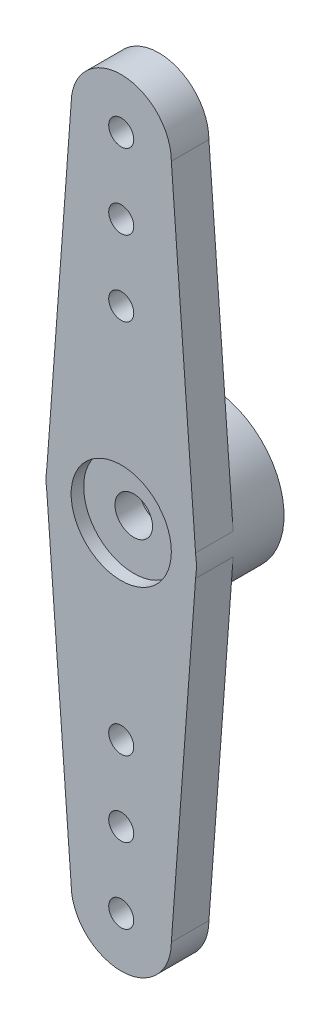
ISO-10303-21;
HEADER;
FILE_DESCRIPTION(('STEP AP214'),'2;1');
FILE_NAME('part.step','',(''),(''),'','','');
FILE_SCHEMA(('AUTOMOTIVE_DESIGN { 1 0 10303 214 1 1 1 1 }'));
ENDSEC;
DATA;
#1=APPLICATION_CONTEXT('core data for automotive mechanical design processes');
#2=APPLICATION_PROTOCOL_DEFINITION('international standard','automotive_design',2000,#1);
#3=PRODUCT_CONTEXT('',#1,'mechanical');
#4=PRODUCT('Part','Part','',(#3));
#5=PRODUCT_RELATED_PRODUCT_CATEGORY('part','',(#4));
#6=PRODUCT_DEFINITION_FORMATION('','',#4);
#7=PRODUCT_DEFINITION_CONTEXT('part definition',#1,'design');
#8=PRODUCT_DEFINITION('design','',#6,#7);
#9=PRODUCT_DEFINITION_SHAPE('','',#8);
#10=(LENGTH_UNIT() NAMED_UNIT(*) SI_UNIT(.MILLI.,.METRE.));
#11=(NAMED_UNIT(*) PLANE_ANGLE_UNIT() SI_UNIT($,.RADIAN.));
#12=(NAMED_UNIT(*) SI_UNIT($,.STERADIAN.) SOLID_ANGLE_UNIT());
#13=UNCERTAINTY_MEASURE_WITH_UNIT(LENGTH_MEASURE(1.E-05),#10,'distance_accuracy_value','');
#14=(GEOMETRIC_REPRESENTATION_CONTEXT(3) GLOBAL_UNCERTAINTY_ASSIGNED_CONTEXT((#13)) GLOBAL_UNIT_ASSIGNED_CONTEXT((#10,
#11,#12)) REPRESENTATION_CONTEXT('',''));
#15=CARTESIAN_POINT('',(0.,0.,0.));
#16=DIRECTION('',(0.,0.,1.));
#17=DIRECTION('',(1.,0.,0.));
#18=AXIS2_PLACEMENT_3D('',#15,#16,#17);
#19=CARTESIAN_POINT('',(0.,7.5,-2.));
#20=DIRECTION('',(0.,0.,1.));
#21=DIRECTION('',(1.,0.,0.));
#22=AXIS2_PLACEMENT_3D('',#19,#20,#21);
#23=CYLINDRICAL_SURFACE('',#22,0.5);
#24=CARTESIAN_POINT('',(0.,7.5,1.5));
#25=DIRECTION('',(0.,0.,1.));
#26=DIRECTION('',(1.,0.,0.));
#27=AXIS2_PLACEMENT_3D('',#24,#25,#26);
#28=CIRCLE('',#27,0.5);
#29=CARTESIAN_POINT('',(0.5,7.5,1.5));
#30=VERTEX_POINT('',#29);
#31=EDGE_CURVE('E43',#30,#30,#28,.T.);
#32=ORIENTED_EDGE('',*,*,#31,.T.);
#33=EDGE_LOOP('',(#32));
#34=FACE_BOUND('',#33,.T.);
#35=CARTESIAN_POINT('',(0.,7.5,0.));
#36=DIRECTION('',(0.,0.,1.));
#37=DIRECTION('',(1.,0.,0.));
#38=AXIS2_PLACEMENT_3D('',#35,#36,#37);
#39=CIRCLE('',#38,0.5);
#40=CARTESIAN_POINT('',(0.5,7.5,0.));
#41=VERTEX_POINT('',#40);
#42=EDGE_CURVE('E11',#41,#41,#39,.T.);
#43=ORIENTED_EDGE('',*,*,#42,.F.);
#44=EDGE_LOOP('',(#43));
#45=FACE_BOUND('',#44,.T.);
#46=ADVANCED_FACE('F34',(#34,#45),#23,.F.);
#47=CARTESIAN_POINT('',(0.,0.,2.));
#48=DIRECTION('',(0.,0.,-1.));
#49=DIRECTION('',(-1.,0.,0.));
#50=AXIS2_PLACEMENT_3D('',#47,#48,#49);
#51=CYLINDRICAL_SURFACE('',#50,0.75);
#52=CARTESIAN_POINT('',(0.,0.,0.));
#53=DIRECTION('',(0.,0.,-1.));
#54=DIRECTION('',(-1.,0.,0.));
#55=AXIS2_PLACEMENT_3D('',#52,#53,#54);
#56=CIRCLE('',#55,0.75);
#57=CARTESIAN_POINT('',(-0.75,0.,0.));
#58=VERTEX_POINT('',#57);
#59=EDGE_CURVE('E157',#58,#58,#56,.T.);
#60=ORIENTED_EDGE('',*,*,#59,.T.);
#61=EDGE_LOOP('',(#60));
#62=FACE_BOUND('',#61,.T.);
#63=CARTESIAN_POINT('',(0.,0.,1.));
#64=DIRECTION('',(0.,0.,1.));
#65=DIRECTION('',(1.,0.,0.));
#66=AXIS2_PLACEMENT_3D('',#63,#64,#65);
#67=CIRCLE('',#66,0.75);
#68=CARTESIAN_POINT('',(0.75,0.,1.));
#69=VERTEX_POINT('',#68);
#70=EDGE_CURVE('E154',#69,#69,#67,.F.);
#71=ORIENTED_EDGE('',*,*,#70,.F.);
#72=EDGE_LOOP('',(#71));
#73=FACE_BOUND('',#72,.T.);
#74=ADVANCED_FACE('F259',(#62,#73),#51,.F.);
#75=CARTESIAN_POINT('',(0.,0.,0.));
#76=DIRECTION('',(0.,0.,1.));
#77=DIRECTION('',(1.,0.,0.));
#78=AXIS2_PLACEMENT_3D('',#75,#76,#77);
#79=PLANE('',#78);
#80=CARTESIAN_POINT('',(0.,10.5,0.));
#81=DIRECTION('',(0.,0.,1.));
#82=DIRECTION('',(1.,0.,0.));
#83=AXIS2_PLACEMENT_3D('',#80,#81,#82);
#84=CIRCLE('',#83,0.5);
#85=CARTESIAN_POINT('',(0.5,10.5,0.));
#86=VERTEX_POINT('',#85);
#87=EDGE_CURVE('E173',#86,#86,#84,.T.);
#88=ORIENTED_EDGE('',*,*,#87,.T.);
#89=EDGE_LOOP('',(#88));
#90=FACE_BOUND('',#89,.T.);
#91=CARTESIAN_POINT('',(0.,13.5,0.));
#92=DIRECTION('',(0.,0.,1.));
#93=DIRECTION('',(1.,0.,0.));
#94=AXIS2_PLACEMENT_3D('',#91,#92,#93);
#95=CIRCLE('',#94,0.5);
#96=CARTESIAN_POINT('',(0.5,13.5,0.));
#97=VERTEX_POINT('',#96);
#98=EDGE_CURVE('E186',#97,#97,#95,.T.);
#99=ORIENTED_EDGE('',*,*,#98,.T.);
#100=EDGE_LOOP('',(#99));
#101=FACE_BOUND('',#100,.T.);
#102=CARTESIAN_POINT('',(0.,0.,0.));
#103=DIRECTION('',(0.,0.,-1.));
#104=DIRECTION('',(-1.,0.,0.));
#105=AXIS2_PLACEMENT_3D('',#102,#103,#104);
#106=CIRCLE('',#105,3.);
#107=CARTESIAN_POINT('',(-2.96725784447476,0.442019099590729,0.));
#108=VERTEX_POINT('',#107);
#109=CARTESIAN_POINT('',(2.96725784447476,0.442019099590722,0.));
#110=VERTEX_POINT('',#109);
#111=EDGE_CURVE('E200',#108,#110,#106,.T.);
#112=ORIENTED_EDGE('',*,*,#111,.F.);
#113=DIRECTION('',(-0.0738716855153118,-0.997267754456709,0.));
#114=VECTOR('',#113,1.);
#115=CARTESIAN_POINT('',(-2.,13.5,0.));
#116=LINE('',#115,#114);
#117=CARTESIAN_POINT('',(-2.,13.5,0.));
#118=VERTEX_POINT('',#117);
#119=EDGE_CURVE('E134',#118,#108,#116,.T.);
#120=ORIENTED_EDGE('',*,*,#119,.F.);
#121=CARTESIAN_POINT('',(0.,13.5,0.));
#122=DIRECTION('',(0.,0.,1.));
#123=DIRECTION('',(1.,0.,0.));
#124=AXIS2_PLACEMENT_3D('',#121,#122,#123);
#125=CIRCLE('',#124,2.);
#126=CARTESIAN_POINT('',(2.,13.5,0.));
#127=VERTEX_POINT('',#126);
#128=EDGE_CURVE('E80',#127,#118,#125,.T.);
#129=ORIENTED_EDGE('',*,*,#128,.F.);
#130=DIRECTION('',(-0.0738716855153118,0.997267754456709,0.));
#131=VECTOR('',#130,1.);
#132=CARTESIAN_POINT('',(2.,13.5,0.));
#133=LINE('',#132,#131);
#134=EDGE_CURVE('E73',#110,#127,#133,.T.);
#135=ORIENTED_EDGE('',*,*,#134,.F.);
#136=EDGE_LOOP('',(#112,#120,#129,#135));
#137=FACE_BOUND('',#136,.T.);
#138=ORIENTED_EDGE('',*,*,#42,.T.);
#139=EDGE_LOOP('',(#138));
#140=FACE_BOUND('',#139,.T.);
#141=ADVANCED_FACE('F226',(#90,#101,#137,#140),#79,.F.);
#142=CARTESIAN_POINT('',(-2.,-13.5,1.5));
#143=DIRECTION('',(0.997267754456709,0.0738716855153118,0.));
#144=DIRECTION('',(-0.0738716855153118,0.997267754456709,0.));
#145=AXIS2_PLACEMENT_3D('',#142,#143,#144);
#146=PLANE('',#145);
#147=DIRECTION('',(0.0738716855153118,-0.997267754456709,0.));
#148=VECTOR('',#147,1.);
#149=CARTESIAN_POINT('',(-2.,-13.5,0.));
#150=LINE('',#149,#148);
#151=CARTESIAN_POINT('',(-2.96725784447476,-0.442019099590729,0.));
#152=VERTEX_POINT('',#151);
#153=CARTESIAN_POINT('',(-2.,-13.5,0.));
#154=VERTEX_POINT('',#153);
#155=EDGE_CURVE('E124',#152,#154,#150,.T.);
#156=ORIENTED_EDGE('',*,*,#155,.T.);
#157=DIRECTION('',(0.,0.,-1.));
#158=VECTOR('',#157,1.);
#159=CARTESIAN_POINT('',(-2.,-13.5,1.5));
#160=LINE('',#159,#158);
#161=CARTESIAN_POINT('',(-2.,-13.5,1.5));
#162=VERTEX_POINT('',#161);
#163=EDGE_CURVE('E148',#162,#154,#160,.T.);
#164=ORIENTED_EDGE('',*,*,#163,.F.);
#165=DIRECTION('',(0.0738716855153118,-0.997267754456709,0.));
#166=VECTOR('',#165,1.);
#167=CARTESIAN_POINT('',(-2.,-13.5,1.5));
#168=LINE('',#167,#166);
#169=CARTESIAN_POINT('',(-2.96725784447476,-0.442019099590729,1.5));
#170=VERTEX_POINT('',#169);
#171=EDGE_CURVE('E89',#170,#162,#168,.T.);
#172=ORIENTED_EDGE('',*,*,#171,.F.);
#173=DIRECTION('',(0.,0.,-1.));
#174=VECTOR('',#173,1.);
#175=CARTESIAN_POINT('',(-2.96725784447476,-0.442019099590729,1.5));
#176=LINE('',#175,#174);
#177=EDGE_CURVE('E151',#170,#152,#176,.T.);
#178=ORIENTED_EDGE('',*,*,#177,.T.);
#179=EDGE_LOOP('',(#156,#164,#172,#178));
#180=FACE_BOUND('',#179,.T.);
#181=ADVANCED_FACE('F234',(#180),#146,.F.);
#182=CARTESIAN_POINT('',(0.,-13.5,1.5));
#183=DIRECTION('',(0.,0.,-1.));
#184=DIRECTION('',(-1.,0.,0.));
#185=AXIS2_PLACEMENT_3D('',#182,#183,#184);
#186=CYLINDRICAL_SURFACE('',#185,2.);
#187=CARTESIAN_POINT('',(0.,-13.5,0.));
#188=DIRECTION('',(0.,0.,1.));
#189=DIRECTION('',(-1.,0.,0.));
#190=AXIS2_PLACEMENT_3D('',#187,#188,#189);
#191=CIRCLE('',#190,2.);
#192=CARTESIAN_POINT('',(2.,-13.5,0.));
#193=VERTEX_POINT('',#192);
#194=EDGE_CURVE('E126',#154,#193,#191,.T.);
#195=ORIENTED_EDGE('',*,*,#194,.T.);
#196=DIRECTION('',(0.,0.,-1.));
#197=VECTOR('',#196,1.);
#198=CARTESIAN_POINT('',(2.,-13.5,1.5));
#199=LINE('',#198,#197);
#200=CARTESIAN_POINT('',(2.,-13.5,1.5));
#201=VERTEX_POINT('',#200);
#202=EDGE_CURVE('E145',#201,#193,#199,.T.);
#203=ORIENTED_EDGE('',*,*,#202,.F.);
#204=CARTESIAN_POINT('',(0.,-13.5,1.5));
#205=DIRECTION('',(0.,0.,1.));
#206=DIRECTION('',(-1.,0.,0.));
#207=AXIS2_PLACEMENT_3D('',#204,#205,#206);
#208=CIRCLE('',#207,2.);
#209=EDGE_CURVE('E209',#162,#201,#208,.T.);
#210=ORIENTED_EDGE('',*,*,#209,.F.);
#211=ORIENTED_EDGE('',*,*,#163,.T.);
#212=EDGE_LOOP('',(#195,#203,#210,#211));
#213=FACE_BOUND('',#212,.T.);
#214=ADVANCED_FACE('F238',(#213),#186,.T.);
#215=CARTESIAN_POINT('',(2.,-13.5,1.5));
#216=DIRECTION('',(-0.997267754456709,0.0738716855153118,0.));
#217=DIRECTION('',(-0.0738716855153118,-0.997267754456709,0.));
#218=AXIS2_PLACEMENT_3D('',#215,#216,#217);
#219=PLANE('',#218);
#220=DIRECTION('',(0.0738716855153118,0.997267754456709,0.));
#221=VECTOR('',#220,1.);
#222=CARTESIAN_POINT('',(2.,-13.5,0.));
#223=LINE('',#222,#221);
#224=CARTESIAN_POINT('',(2.96725784447476,-0.44201909959073,0.));
#225=VERTEX_POINT('',#224);
#226=EDGE_CURVE('E129',#193,#225,#223,.T.);
#227=ORIENTED_EDGE('',*,*,#226,.T.);
#228=DIRECTION('',(0.,0.,-1.));
#229=VECTOR('',#228,1.);
#230=CARTESIAN_POINT('',(2.96725784447476,-0.44201909959073,1.5));
#231=LINE('',#230,#229);
#232=CARTESIAN_POINT('',(2.96725784447476,-0.44201909959073,1.5));
#233=VERTEX_POINT('',#232);
#234=EDGE_CURVE('E142',#233,#225,#231,.T.);
#235=ORIENTED_EDGE('',*,*,#234,.F.);
#236=DIRECTION('',(0.0738716855153118,0.997267754456709,0.));
#237=VECTOR('',#236,1.);
#238=CARTESIAN_POINT('',(2.,-13.5,1.5));
#239=LINE('',#238,#237);
#240=EDGE_CURVE('E211',#201,#233,#239,.T.);
#241=ORIENTED_EDGE('',*,*,#240,.F.);
#242=ORIENTED_EDGE('',*,*,#202,.T.);
#243=EDGE_LOOP('',(#227,#235,#241,#242));
#244=FACE_BOUND('',#243,.T.);
#245=ADVANCED_FACE('F217',(#244),#219,.F.);
#246=CARTESIAN_POINT('',(0.,0.,1.5));
#247=DIRECTION('',(0.,0.,-1.));
#248=DIRECTION('',(-1.,0.,0.));
#249=AXIS2_PLACEMENT_3D('',#246,#247,#248);
#250=CYLINDRICAL_SURFACE('',#249,3.);
#251=ORIENTED_EDGE('',*,*,#234,.T.);
#252=EDGE_CURVE('E153',#225,#152,#106,.T.);
#253=ORIENTED_EDGE('',*,*,#252,.T.);
#254=ORIENTED_EDGE('',*,*,#177,.F.);
#255=CARTESIAN_POINT('',(0.,0.,1.5));
#256=DIRECTION('',(0.,0.,1.));
#257=DIRECTION('',(1.,0.,0.));
#258=AXIS2_PLACEMENT_3D('',#255,#256,#257);
#259=CIRCLE('',#258,3.);
#260=CARTESIAN_POINT('',(-2.96725784447476,0.442019099590729,1.5));
#261=VERTEX_POINT('',#260);
#262=EDGE_CURVE('E137',#261,#170,#259,.T.);
#263=ORIENTED_EDGE('',*,*,#262,.F.);
#264=DIRECTION('',(0.,0.,-1.));
#265=VECTOR('',#264,1.);
#266=CARTESIAN_POINT('',(-2.96725784447476,0.442019099590729,1.5));
#267=LINE('',#266,#265);
#268=EDGE_CURVE('E120',#261,#108,#267,.T.);
#269=ORIENTED_EDGE('',*,*,#268,.T.);
#270=ORIENTED_EDGE('',*,*,#111,.T.);
#271=DIRECTION('',(0.,0.,-1.));
#272=VECTOR('',#271,1.);
#273=CARTESIAN_POINT('',(2.96725784447476,0.442019099590729,1.5));
#274=LINE('',#273,#272);
#275=CARTESIAN_POINT('',(2.96725784447476,0.442019099590729,1.5));
#276=VERTEX_POINT('',#275);
#277=EDGE_CURVE('E115',#276,#110,#274,.T.);
#278=ORIENTED_EDGE('',*,*,#277,.F.);
#279=CARTESIAN_POINT('',(0.,0.,1.5));
#280=DIRECTION('',(0.,0.,1.));
#281=DIRECTION('',(1.,0.,0.));
#282=AXIS2_PLACEMENT_3D('',#279,#280,#281);
#283=CIRCLE('',#282,3.);
#284=EDGE_CURVE('E110',#233,#276,#283,.T.);
#285=ORIENTED_EDGE('',*,*,#284,.F.);
#286=EDGE_LOOP('',(#251,#253,#254,#263,#269,#270,#278,#285));
#287=FACE_BOUND('',#286,.T.);
#288=CARTESIAN_POINT('',(0.,0.,-2.));
#289=DIRECTION('',(0.,0.,-1.));
#290=DIRECTION('',(-1.,0.,0.));
#291=AXIS2_PLACEMENT_3D('',#288,#289,#290);
#292=CIRCLE('',#291,3.);
#293=CARTESIAN_POINT('',(-3.,0.,-2.));
#294=VERTEX_POINT('',#293);
#295=EDGE_CURVE('E127',#294,#294,#292,.T.);
#296=ORIENTED_EDGE('',*,*,#295,.F.);
#297=EDGE_LOOP('',(#296));
#298=FACE_BOUND('',#297,.T.);
#299=ADVANCED_FACE('F220',(#287,#298),#250,.T.);
#300=CARTESIAN_POINT('',(2.,13.5,1.5));
#301=DIRECTION('',(-0.997267754456709,-0.0738716855153118,0.));
#302=DIRECTION('',(0.0738716855153118,-0.997267754456709,0.));
#303=AXIS2_PLACEMENT_3D('',#300,#301,#302);
#304=PLANE('',#303);
#305=ORIENTED_EDGE('',*,*,#134,.T.);
#306=DIRECTION('',(0.,0.,-1.));
#307=VECTOR('',#306,1.);
#308=CARTESIAN_POINT('',(2.,13.5,1.5));
#309=LINE('',#308,#307);
#310=CARTESIAN_POINT('',(2.,13.5,1.5));
#311=VERTEX_POINT('',#310);
#312=EDGE_CURVE('E113',#311,#127,#309,.T.);
#313=ORIENTED_EDGE('',*,*,#312,.F.);
#314=DIRECTION('',(-0.0738716855153118,0.997267754456709,0.));
#315=VECTOR('',#314,1.);
#316=CARTESIAN_POINT('',(2.,13.5,1.5));
#317=LINE('',#316,#315);
#318=EDGE_CURVE('E104',#276,#311,#317,.T.);
#319=ORIENTED_EDGE('',*,*,#318,.F.);
#320=ORIENTED_EDGE('',*,*,#277,.T.);
#321=EDGE_LOOP('',(#305,#313,#319,#320));
#322=FACE_BOUND('',#321,.T.);
#323=ADVANCED_FACE('F114',(#322),#304,.F.);
#324=CARTESIAN_POINT('',(0.,13.5,1.5));
#325=DIRECTION('',(0.,0.,-1.));
#326=DIRECTION('',(-1.,0.,0.));
#327=AXIS2_PLACEMENT_3D('',#324,#325,#326);
#328=CYLINDRICAL_SURFACE('',#327,2.);
#329=ORIENTED_EDGE('',*,*,#128,.T.);
#330=DIRECTION('',(0.,0.,-1.));
#331=VECTOR('',#330,1.);
#332=CARTESIAN_POINT('',(-2.,13.5,1.5));
#333=LINE('',#332,#331);
#334=CARTESIAN_POINT('',(-2.,13.5,1.5));
#335=VERTEX_POINT('',#334);
#336=EDGE_CURVE('E116',#335,#118,#333,.T.);
#337=ORIENTED_EDGE('',*,*,#336,.F.);
#338=CARTESIAN_POINT('',(0.,13.5,1.5));
#339=DIRECTION('',(0.,0.,1.));
#340=DIRECTION('',(1.,0.,0.));
#341=AXIS2_PLACEMENT_3D('',#338,#339,#340);
#342=CIRCLE('',#341,2.);
#343=EDGE_CURVE('E108',#311,#335,#342,.T.);
#344=ORIENTED_EDGE('',*,*,#343,.F.);
#345=ORIENTED_EDGE('',*,*,#312,.T.);
#346=EDGE_LOOP('',(#329,#337,#344,#345));
#347=FACE_BOUND('',#346,.T.);
#348=ADVANCED_FACE('F118',(#347),#328,.T.);
#349=CARTESIAN_POINT('',(-2.,13.5,1.5));
#350=DIRECTION('',(0.997267754456709,-0.0738716855153118,0.));
#351=DIRECTION('',(0.0738716855153118,0.997267754456709,0.));
#352=AXIS2_PLACEMENT_3D('',#349,#350,#351);
#353=PLANE('',#352);
#354=ORIENTED_EDGE('',*,*,#119,.T.);
#355=ORIENTED_EDGE('',*,*,#268,.F.);
#356=DIRECTION('',(-0.0738716855153118,-0.997267754456709,0.));
#357=VECTOR('',#356,1.);
#358=CARTESIAN_POINT('',(-2.,13.5,1.5));
#359=LINE('',#358,#357);
#360=EDGE_CURVE('E52',#335,#261,#359,.T.);
#361=ORIENTED_EDGE('',*,*,#360,.F.);
#362=ORIENTED_EDGE('',*,*,#336,.T.);
#363=EDGE_LOOP('',(#354,#355,#361,#362));
#364=FACE_BOUND('',#363,.T.);
#365=ADVANCED_FACE('F230',(#364),#353,.F.);
#366=CARTESIAN_POINT('',(0.,0.,1.5));
#367=DIRECTION('',(0.,0.,1.));
#368=DIRECTION('',(1.,0.,0.));
#369=AXIS2_PLACEMENT_3D('',#366,#367,#368);
#370=PLANE('',#369);
#371=CARTESIAN_POINT('',(0.,-13.5,1.5));
#372=DIRECTION('',(0.,0.,-1.));
#373=DIRECTION('',(1.,0.,0.));
#374=AXIS2_PLACEMENT_3D('',#371,#372,#373);
#375=CIRCLE('',#374,0.5);
#376=CARTESIAN_POINT('',(0.5,-13.5,1.5));
#377=VERTEX_POINT('',#376);
#378=EDGE_CURVE('E164',#377,#377,#375,.T.);
#379=ORIENTED_EDGE('',*,*,#378,.T.);
#380=EDGE_LOOP('',(#379));
#381=FACE_BOUND('',#380,.T.);
#382=CARTESIAN_POINT('',(0.,-10.5,1.5));
#383=DIRECTION('',(0.,0.,-1.));
#384=DIRECTION('',(1.,0.,0.));
#385=AXIS2_PLACEMENT_3D('',#382,#383,#384);
#386=CIRCLE('',#385,0.5);
#387=CARTESIAN_POINT('',(0.5,-10.5,1.5));
#388=VERTEX_POINT('',#387);
#389=EDGE_CURVE('E457',#388,#388,#386,.T.);
#390=ORIENTED_EDGE('',*,*,#389,.T.);
#391=EDGE_LOOP('',(#390));
#392=FACE_BOUND('',#391,.T.);
#393=CARTESIAN_POINT('',(0.,-7.5,1.5));
#394=DIRECTION('',(0.,0.,-1.));
#395=DIRECTION('',(1.,0.,0.));
#396=AXIS2_PLACEMENT_3D('',#393,#394,#395);
#397=CIRCLE('',#396,0.5);
#398=CARTESIAN_POINT('',(0.5,-7.5,1.5));
#399=VERTEX_POINT('',#398);
#400=EDGE_CURVE('E181',#399,#399,#397,.T.);
#401=ORIENTED_EDGE('',*,*,#400,.T.);
#402=EDGE_LOOP('',(#401));
#403=FACE_BOUND('',#402,.T.);
#404=CARTESIAN_POINT('',(0.,10.5,1.5));
#405=DIRECTION('',(0.,0.,1.));
#406=DIRECTION('',(1.,0.,0.));
#407=AXIS2_PLACEMENT_3D('',#404,#405,#406);
#408=CIRCLE('',#407,0.5);
#409=CARTESIAN_POINT('',(0.5,10.5,1.5));
#410=VERTEX_POINT('',#409);
#411=EDGE_CURVE('E169',#410,#410,#408,.T.);
#412=ORIENTED_EDGE('',*,*,#411,.F.);
#413=EDGE_LOOP('',(#412));
#414=FACE_BOUND('',#413,.T.);
#415=CARTESIAN_POINT('',(0.,13.5,1.5));
#416=DIRECTION('',(0.,0.,1.));
#417=DIRECTION('',(1.,0.,0.));
#418=AXIS2_PLACEMENT_3D('',#415,#416,#417);
#419=CIRCLE('',#418,0.5);
#420=CARTESIAN_POINT('',(0.5,13.5,1.5));
#421=VERTEX_POINT('',#420);
#422=EDGE_CURVE('E178',#421,#421,#419,.T.);
#423=ORIENTED_EDGE('',*,*,#422,.F.);
#424=EDGE_LOOP('',(#423));
#425=FACE_BOUND('',#424,.T.);
#426=CARTESIAN_POINT('',(0.,0.,1.5));
#427=DIRECTION('',(0.,0.,1.));
#428=DIRECTION('',(1.,0.,0.));
#429=AXIS2_PLACEMENT_3D('',#426,#427,#428);
#430=CIRCLE('',#429,2.);
#431=CARTESIAN_POINT('',(2.,0.,1.5));
#432=VERTEX_POINT('',#431);
#433=EDGE_CURVE('E189',#432,#432,#430,.T.);
#434=ORIENTED_EDGE('',*,*,#433,.F.);
#435=EDGE_LOOP('',(#434));
#436=FACE_BOUND('',#435,.T.);
#437=ORIENTED_EDGE('',*,*,#262,.T.);
#438=ORIENTED_EDGE('',*,*,#171,.T.);
#439=ORIENTED_EDGE('',*,*,#209,.T.);
#440=ORIENTED_EDGE('',*,*,#240,.T.);
#441=ORIENTED_EDGE('',*,*,#284,.T.);
#442=ORIENTED_EDGE('',*,*,#318,.T.);
#443=ORIENTED_EDGE('',*,*,#343,.T.);
#444=ORIENTED_EDGE('',*,*,#360,.T.);
#445=EDGE_LOOP('',(#437,#438,#439,#440,#441,#442,#443,#444));
#446=FACE_BOUND('',#445,.T.);
#447=ORIENTED_EDGE('',*,*,#31,.F.);
#448=EDGE_LOOP('',(#447));
#449=FACE_BOUND('',#448,.T.);
#450=ADVANCED_FACE('F105',(#381,#392,#403,#414,#425,#436,#446,#449),#370,.T.);
#451=CARTESIAN_POINT('',(0.,-13.5,0.));
#452=DIRECTION('',(0.,0.,1.));
#453=DIRECTION('',(1.,0.,0.));
#454=AXIS2_PLACEMENT_3D('',#451,#452,#453);
#455=CIRCLE('',#454,0.5);
#456=CARTESIAN_POINT('',(0.5,-13.5,0.));
#457=VERTEX_POINT('',#456);
#458=EDGE_CURVE('E37',#457,#457,#455,.F.);
#459=ORIENTED_EDGE('',*,*,#458,.F.);
#460=EDGE_LOOP('',(#459));
#461=FACE_BOUND('',#460,.T.);
#462=CARTESIAN_POINT('',(0.,-10.5,0.));
#463=DIRECTION('',(0.,0.,1.));
#464=DIRECTION('',(1.,0.,0.));
#465=AXIS2_PLACEMENT_3D('',#462,#463,#464);
#466=CIRCLE('',#465,0.5);
#467=CARTESIAN_POINT('',(0.5,-10.5,0.));
#468=VERTEX_POINT('',#467);
#469=EDGE_CURVE('E163',#468,#468,#466,.F.);
#470=ORIENTED_EDGE('',*,*,#469,.F.);
#471=EDGE_LOOP('',(#470));
#472=FACE_BOUND('',#471,.T.);
#473=CARTESIAN_POINT('',(0.,-7.5,0.));
#474=DIRECTION('',(0.,0.,1.));
#475=DIRECTION('',(1.,0.,0.));
#476=AXIS2_PLACEMENT_3D('',#473,#474,#475);
#477=CIRCLE('',#476,0.5);
#478=CARTESIAN_POINT('',(0.5,-7.5,0.));
#479=VERTEX_POINT('',#478);
#480=EDGE_CURVE('E161',#479,#479,#477,.F.);
#481=ORIENTED_EDGE('',*,*,#480,.F.);
#482=EDGE_LOOP('',(#481));
#483=FACE_BOUND('',#482,.T.);
#484=ORIENTED_EDGE('',*,*,#252,.F.);
#485=ORIENTED_EDGE('',*,*,#226,.F.);
#486=ORIENTED_EDGE('',*,*,#194,.F.);
#487=ORIENTED_EDGE('',*,*,#155,.F.);
#488=EDGE_LOOP('',(#484,#485,#486,#487));
#489=FACE_BOUND('',#488,.T.);
#490=ADVANCED_FACE('F241',(#461,#472,#483,#489),#79,.F.);
#491=CARTESIAN_POINT('',(0.,0.,-2.));
#492=DIRECTION('',(0.,0.,-1.));
#493=DIRECTION('',(-1.,0.,0.));
#494=AXIS2_PLACEMENT_3D('',#491,#492,#493);
#495=PLANE('',#494);
#496=ORIENTED_EDGE('',*,*,#295,.T.);
#497=EDGE_LOOP('',(#496));
#498=FACE_BOUND('',#497,.T.);
#499=CARTESIAN_POINT('',(0.,0.,-2.));
#500=DIRECTION('',(0.,0.,-1.));
#501=DIRECTION('',(-1.,0.,0.));
#502=AXIS2_PLACEMENT_3D('',#499,#500,#501);
#503=CIRCLE('',#502,2.);
#504=CARTESIAN_POINT('',(-2.,0.,-2.));
#505=VERTEX_POINT('',#504);
#506=EDGE_CURVE('E197',#505,#505,#503,.T.);
#507=ORIENTED_EDGE('',*,*,#506,.F.);
#508=EDGE_LOOP('',(#507));
#509=FACE_BOUND('',#508,.T.);
#510=ADVANCED_FACE('F243',(#498,#509),#495,.T.);
#511=CARTESIAN_POINT('',(0.,0.,-2.));
#512=DIRECTION('',(0.,0.,1.));
#513=DIRECTION('',(1.,0.,0.));
#514=AXIS2_PLACEMENT_3D('',#511,#512,#513);
#515=CYLINDRICAL_SURFACE('',#514,2.);
#516=ORIENTED_EDGE('',*,*,#506,.T.);
#517=EDGE_LOOP('',(#516));
#518=FACE_BOUND('',#517,.T.);
#519=CARTESIAN_POINT('',(0.,0.,0.));
#520=DIRECTION('',(0.,0.,-1.));
#521=DIRECTION('',(-1.,0.,0.));
#522=AXIS2_PLACEMENT_3D('',#519,#520,#521);
#523=CIRCLE('',#522,2.);
#524=CARTESIAN_POINT('',(-2.,0.,0.));
#525=VERTEX_POINT('',#524);
#526=EDGE_CURVE('E196',#525,#525,#523,.T.);
#527=ORIENTED_EDGE('',*,*,#526,.F.);
#528=EDGE_LOOP('',(#527));
#529=FACE_BOUND('',#528,.T.);
#530=ADVANCED_FACE('F251',(#518,#529),#515,.F.);
#531=ORIENTED_EDGE('',*,*,#59,.F.);
#532=EDGE_LOOP('',(#531));
#533=FACE_BOUND('',#532,.T.);
#534=ORIENTED_EDGE('',*,*,#526,.T.);
#535=EDGE_LOOP('',(#534));
#536=FACE_BOUND('',#535,.T.);
#537=ADVANCED_FACE('F246',(#533,#536),#79,.F.);
#538=CARTESIAN_POINT('',(0.,0.,1.));
#539=DIRECTION('',(0.,0.,1.));
#540=DIRECTION('',(1.,0.,0.));
#541=AXIS2_PLACEMENT_3D('',#538,#539,#540);
#542=PLANE('',#541);
#543=CARTESIAN_POINT('',(0.,0.,1.));
#544=DIRECTION('',(0.,0.,1.));
#545=DIRECTION('',(1.,0.,0.));
#546=AXIS2_PLACEMENT_3D('',#543,#544,#545);
#547=CIRCLE('',#546,2.);
#548=CARTESIAN_POINT('',(2.,0.,1.));
#549=VERTEX_POINT('',#548);
#550=EDGE_CURVE('E158',#549,#549,#547,.T.);
#551=ORIENTED_EDGE('',*,*,#550,.T.);
#552=EDGE_LOOP('',(#551));
#553=FACE_BOUND('',#552,.T.);
#554=ORIENTED_EDGE('',*,*,#70,.T.);
#555=EDGE_LOOP('',(#554));
#556=FACE_BOUND('',#555,.T.);
#557=ADVANCED_FACE('F262',(#553,#556),#542,.T.);
#558=CARTESIAN_POINT('',(0.,0.,1.));
#559=DIRECTION('',(0.,0.,1.));
#560=DIRECTION('',(1.,0.,0.));
#561=AXIS2_PLACEMENT_3D('',#558,#559,#560);
#562=CYLINDRICAL_SURFACE('',#561,2.);
#563=ORIENTED_EDGE('',*,*,#550,.F.);
#564=EDGE_LOOP('',(#563));
#565=FACE_BOUND('',#564,.T.);
#566=ORIENTED_EDGE('',*,*,#433,.T.);
#567=EDGE_LOOP('',(#566));
#568=FACE_BOUND('',#567,.T.);
#569=ADVANCED_FACE('F279',(#565,#568),#562,.F.);
#570=CARTESIAN_POINT('',(0.,13.5,-2.));
#571=DIRECTION('',(0.,0.,1.));
#572=DIRECTION('',(1.,0.,0.));
#573=AXIS2_PLACEMENT_3D('',#570,#571,#572);
#574=CYLINDRICAL_SURFACE('',#573,0.5);
#575=ORIENTED_EDGE('',*,*,#422,.T.);
#576=EDGE_LOOP('',(#575));
#577=FACE_BOUND('',#576,.T.);
#578=ORIENTED_EDGE('',*,*,#98,.F.);
#579=EDGE_LOOP('',(#578));
#580=FACE_BOUND('',#579,.T.);
#581=ADVANCED_FACE('F308',(#577,#580),#574,.F.);
#582=CARTESIAN_POINT('',(0.,10.5,-2.));
#583=DIRECTION('',(0.,0.,1.));
#584=DIRECTION('',(1.,0.,0.));
#585=AXIS2_PLACEMENT_3D('',#582,#583,#584);
#586=CYLINDRICAL_SURFACE('',#585,0.5);
#587=ORIENTED_EDGE('',*,*,#411,.T.);
#588=EDGE_LOOP('',(#587));
#589=FACE_BOUND('',#588,.T.);
#590=ORIENTED_EDGE('',*,*,#87,.F.);
#591=EDGE_LOOP('',(#590));
#592=FACE_BOUND('',#591,.T.);
#593=ADVANCED_FACE('F315',(#589,#592),#586,.F.);
#594=CARTESIAN_POINT('',(0.,-7.5,-2.));
#595=DIRECTION('',(0.,0.,1.));
#596=DIRECTION('',(1.,0.,0.));
#597=AXIS2_PLACEMENT_3D('',#594,#595,#596);
#598=CYLINDRICAL_SURFACE('',#597,0.5);
#599=ORIENTED_EDGE('',*,*,#400,.F.);
#600=EDGE_LOOP('',(#599));
#601=FACE_BOUND('',#600,.T.);
#602=ORIENTED_EDGE('',*,*,#480,.T.);
#603=EDGE_LOOP('',(#602));
#604=FACE_BOUND('',#603,.T.);
#605=ADVANCED_FACE('F323',(#601,#604),#598,.F.);
#606=CARTESIAN_POINT('',(0.,-10.5,-2.));
#607=DIRECTION('',(0.,0.,1.));
#608=DIRECTION('',(1.,0.,0.));
#609=AXIS2_PLACEMENT_3D('',#606,#607,#608);
#610=CYLINDRICAL_SURFACE('',#609,0.5);
#611=ORIENTED_EDGE('',*,*,#389,.F.);
#612=EDGE_LOOP('',(#611));
#613=FACE_BOUND('',#612,.T.);
#614=ORIENTED_EDGE('',*,*,#469,.T.);
#615=EDGE_LOOP('',(#614));
#616=FACE_BOUND('',#615,.T.);
#617=ADVANCED_FACE('F332',(#613,#616),#610,.F.);
#618=CARTESIAN_POINT('',(0.,-13.5,-2.));
#619=DIRECTION('',(0.,0.,1.));
#620=DIRECTION('',(1.,0.,0.));
#621=AXIS2_PLACEMENT_3D('',#618,#619,#620);
#622=CYLINDRICAL_SURFACE('',#621,0.5);
#623=ORIENTED_EDGE('',*,*,#378,.F.);
#624=EDGE_LOOP('',(#623));
#625=FACE_BOUND('',#624,.T.);
#626=ORIENTED_EDGE('',*,*,#458,.T.);
#627=EDGE_LOOP('',(#626));
#628=FACE_BOUND('',#627,.T.);
#629=ADVANCED_FACE('F340',(#625,#628),#622,.F.);
#630=CLOSED_SHELL('',(#46,#74,#141,#181,#214,#245,#299,#323,#348,#365,#450,#490,#510,#530,#537,
#557,#569,#581,#593,#605,#617,#629));
#631=MANIFOLD_SOLID_BREP('B2',#630);
#632=ADVANCED_BREP_SHAPE_REPRESENTATION('',(#18,#631),#14);
#633=SHAPE_DEFINITION_REPRESENTATION(#9,#632);
ENDSEC;
END-ISO-10303-21;
